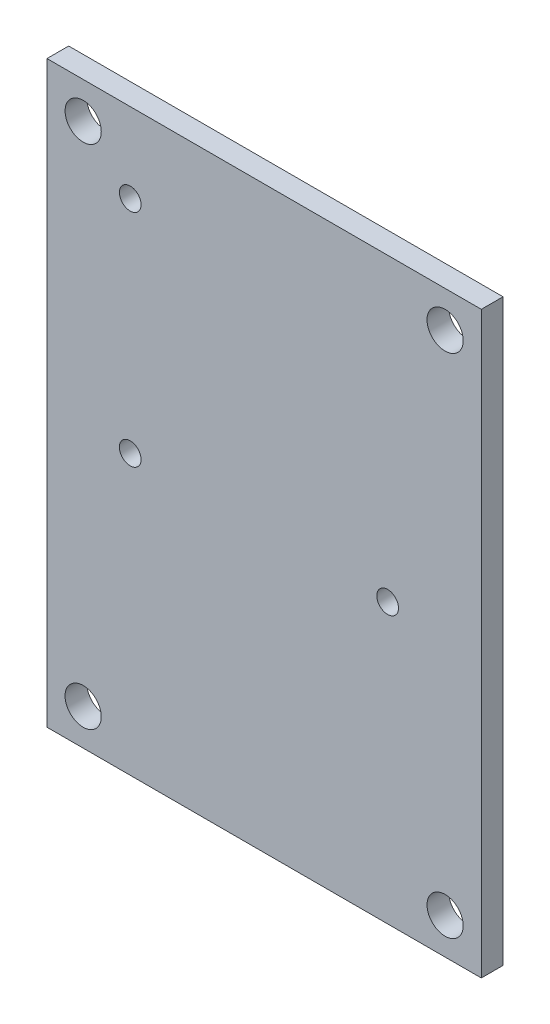
ISO-10303-21;
HEADER;
FILE_DESCRIPTION(('STEP AP214'),'2;1');
FILE_NAME('part.step','',(''),(''),'','','');
FILE_SCHEMA(('AUTOMOTIVE_DESIGN { 1 0 10303 214 1 1 1 1 }'));
ENDSEC;
DATA;
#1=APPLICATION_CONTEXT('core data for automotive mechanical design processes');
#2=APPLICATION_PROTOCOL_DEFINITION('international standard','automotive_design',2000,#1);
#3=PRODUCT_CONTEXT('',#1,'mechanical');
#4=PRODUCT('Part','Part','',(#3));
#5=PRODUCT_RELATED_PRODUCT_CATEGORY('part','',(#4));
#6=PRODUCT_DEFINITION_FORMATION('','',#4);
#7=PRODUCT_DEFINITION_CONTEXT('part definition',#1,'design');
#8=PRODUCT_DEFINITION('design','',#6,#7);
#9=PRODUCT_DEFINITION_SHAPE('','',#8);
#10=(LENGTH_UNIT() NAMED_UNIT(*) SI_UNIT(.MILLI.,.METRE.));
#11=(NAMED_UNIT(*) PLANE_ANGLE_UNIT() SI_UNIT($,.RADIAN.));
#12=(NAMED_UNIT(*) SI_UNIT($,.STERADIAN.) SOLID_ANGLE_UNIT());
#13=UNCERTAINTY_MEASURE_WITH_UNIT(LENGTH_MEASURE(1.E-05),#10,'distance_accuracy_value','');
#14=(GEOMETRIC_REPRESENTATION_CONTEXT(3) GLOBAL_UNCERTAINTY_ASSIGNED_CONTEXT((#13)) GLOBAL_UNIT_ASSIGNED_CONTEXT((#10,
#11,#12)) REPRESENTATION_CONTEXT('',''));
#15=CARTESIAN_POINT('',(0.,0.,0.));
#16=DIRECTION('',(0.,0.,1.));
#17=DIRECTION('',(1.,0.,0.));
#18=AXIS2_PLACEMENT_3D('',#15,#16,#17);
#19=CARTESIAN_POINT('',(30.,40.,-3.));
#20=DIRECTION('',(1.,0.,0.));
#21=DIRECTION('',(0.,1.,0.));
#22=AXIS2_PLACEMENT_3D('',#19,#20,#21);
#23=PLANE('',#22);
#24=DIRECTION('',(0.,1.,0.));
#25=VECTOR('',#24,1.);
#26=CARTESIAN_POINT('',(30.,40.,0.));
#27=LINE('',#26,#25);
#28=CARTESIAN_POINT('',(30.,-40.,0.));
#29=VERTEX_POINT('',#28);
#30=CARTESIAN_POINT('',(30.,40.,0.));
#31=VERTEX_POINT('',#30);
#32=EDGE_CURVE('E102',#29,#31,#27,.T.);
#33=ORIENTED_EDGE('',*,*,#32,.F.);
#34=DIRECTION('',(0.,0.,1.));
#35=VECTOR('',#34,1.);
#36=CARTESIAN_POINT('',(30.,-40.,-3.));
#37=LINE('',#36,#35);
#38=CARTESIAN_POINT('',(30.,-40.,-3.));
#39=VERTEX_POINT('',#38);
#40=EDGE_CURVE('E11',#39,#29,#37,.T.);
#41=ORIENTED_EDGE('',*,*,#40,.F.);
#42=DIRECTION('',(0.,1.,0.));
#43=VECTOR('',#42,1.);
#44=CARTESIAN_POINT('',(30.,40.,-3.));
#45=LINE('',#44,#43);
#46=CARTESIAN_POINT('',(30.,40.,-3.));
#47=VERTEX_POINT('',#46);
#48=EDGE_CURVE('E95',#39,#47,#45,.T.);
#49=ORIENTED_EDGE('',*,*,#48,.T.);
#50=DIRECTION('',(0.,0.,1.));
#51=VECTOR('',#50,1.);
#52=CARTESIAN_POINT('',(30.,40.,-3.));
#53=LINE('',#52,#51);
#54=EDGE_CURVE('E40',#47,#31,#53,.T.);
#55=ORIENTED_EDGE('',*,*,#54,.T.);
#56=EDGE_LOOP('',(#33,#41,#49,#55));
#57=FACE_BOUND('',#56,.T.);
#58=ADVANCED_FACE('F37',(#57),#23,.T.);
#59=CARTESIAN_POINT('',(-30.,-40.,-3.));
#60=DIRECTION('',(0.,-1.,0.));
#61=DIRECTION('',(0.,0.,-1.));
#62=AXIS2_PLACEMENT_3D('',#59,#60,#61);
#63=PLANE('',#62);
#64=DIRECTION('',(1.,0.,0.));
#65=VECTOR('',#64,1.);
#66=CARTESIAN_POINT('',(-30.,-40.,0.));
#67=LINE('',#66,#65);
#68=CARTESIAN_POINT('',(-30.,-40.,0.));
#69=VERTEX_POINT('',#68);
#70=EDGE_CURVE('E97',#69,#29,#67,.T.);
#71=ORIENTED_EDGE('',*,*,#70,.F.);
#72=DIRECTION('',(0.,0.,1.));
#73=VECTOR('',#72,1.);
#74=CARTESIAN_POINT('',(-30.,-40.,-3.));
#75=LINE('',#74,#73);
#76=CARTESIAN_POINT('',(-30.,-40.,-3.));
#77=VERTEX_POINT('',#76);
#78=EDGE_CURVE('E46',#77,#69,#75,.T.);
#79=ORIENTED_EDGE('',*,*,#78,.F.);
#80=DIRECTION('',(1.,0.,0.));
#81=VECTOR('',#80,1.);
#82=CARTESIAN_POINT('',(-30.,-40.,-3.));
#83=LINE('',#82,#81);
#84=EDGE_CURVE('E92',#77,#39,#83,.T.);
#85=ORIENTED_EDGE('',*,*,#84,.T.);
#86=ORIENTED_EDGE('',*,*,#40,.T.);
#87=EDGE_LOOP('',(#71,#79,#85,#86));
#88=FACE_BOUND('',#87,.T.);
#89=ADVANCED_FACE('F113',(#88),#63,.T.);
#90=CARTESIAN_POINT('',(-30.,40.,-3.));
#91=DIRECTION('',(-1.,0.,0.));
#92=DIRECTION('',(0.,-1.,0.));
#93=AXIS2_PLACEMENT_3D('',#90,#91,#92);
#94=PLANE('',#93);
#95=DIRECTION('',(0.,-1.,0.));
#96=VECTOR('',#95,1.);
#97=CARTESIAN_POINT('',(-30.,40.,0.));
#98=LINE('',#97,#96);
#99=CARTESIAN_POINT('',(-30.,40.,0.));
#100=VERTEX_POINT('',#99);
#101=EDGE_CURVE('E87',#100,#69,#98,.T.);
#102=ORIENTED_EDGE('',*,*,#101,.F.);
#103=DIRECTION('',(0.,0.,1.));
#104=VECTOR('',#103,1.);
#105=CARTESIAN_POINT('',(-30.,40.,-3.));
#106=LINE('',#105,#104);
#107=CARTESIAN_POINT('',(-30.,40.,-3.));
#108=VERTEX_POINT('',#107);
#109=EDGE_CURVE('E82',#108,#100,#106,.T.);
#110=ORIENTED_EDGE('',*,*,#109,.F.);
#111=DIRECTION('',(0.,-1.,0.));
#112=VECTOR('',#111,1.);
#113=CARTESIAN_POINT('',(-30.,40.,-3.));
#114=LINE('',#113,#112);
#115=EDGE_CURVE('E85',#108,#77,#114,.T.);
#116=ORIENTED_EDGE('',*,*,#115,.T.);
#117=ORIENTED_EDGE('',*,*,#78,.T.);
#118=EDGE_LOOP('',(#102,#110,#116,#117));
#119=FACE_BOUND('',#118,.T.);
#120=ADVANCED_FACE('F84',(#119),#94,.T.);
#121=CARTESIAN_POINT('',(-30.,40.,-3.));
#122=DIRECTION('',(0.,1.,0.));
#123=DIRECTION('',(0.,0.,1.));
#124=AXIS2_PLACEMENT_3D('',#121,#122,#123);
#125=PLANE('',#124);
#126=DIRECTION('',(-1.,0.,0.));
#127=VECTOR('',#126,1.);
#128=CARTESIAN_POINT('',(-30.,40.,0.));
#129=LINE('',#128,#127);
#130=EDGE_CURVE('E105',#31,#100,#129,.T.);
#131=ORIENTED_EDGE('',*,*,#130,.F.);
#132=ORIENTED_EDGE('',*,*,#54,.F.);
#133=DIRECTION('',(-1.,0.,0.));
#134=VECTOR('',#133,1.);
#135=CARTESIAN_POINT('',(-30.,40.,-3.));
#136=LINE('',#135,#134);
#137=EDGE_CURVE('E91',#47,#108,#136,.T.);
#138=ORIENTED_EDGE('',*,*,#137,.T.);
#139=ORIENTED_EDGE('',*,*,#109,.T.);
#140=EDGE_LOOP('',(#131,#132,#138,#139));
#141=FACE_BOUND('',#140,.T.);
#142=ADVANCED_FACE('F94',(#141),#125,.T.);
#143=CARTESIAN_POINT('',(0.,0.,-3.));
#144=DIRECTION('',(0.,0.,1.));
#145=DIRECTION('',(1.,0.,0.));
#146=AXIS2_PLACEMENT_3D('',#143,#144,#145);
#147=PLANE('',#146);
#148=CARTESIAN_POINT('',(-18.5,29.,-3.));
#149=DIRECTION('',(0.,0.,1.));
#150=DIRECTION('',(1.,0.,0.));
#151=AXIS2_PLACEMENT_3D('',#148,#149,#150);
#152=CIRCLE('',#151,1.5);
#153=CARTESIAN_POINT('',(-17.,29.,-3.));
#154=VERTEX_POINT('',#153);
#155=EDGE_CURVE('E166',#154,#154,#152,.T.);
#156=ORIENTED_EDGE('',*,*,#155,.T.);
#157=EDGE_LOOP('',(#156));
#158=FACE_BOUND('',#157,.T.);
#159=CARTESIAN_POINT('',(-18.5,-1.48,-3.));
#160=DIRECTION('',(0.,0.,1.));
#161=DIRECTION('',(1.,0.,0.));
#162=AXIS2_PLACEMENT_3D('',#159,#160,#161);
#163=CIRCLE('',#162,1.5);
#164=CARTESIAN_POINT('',(-17.,-1.48,-3.));
#165=VERTEX_POINT('',#164);
#166=EDGE_CURVE('E170',#165,#165,#163,.T.);
#167=ORIENTED_EDGE('',*,*,#166,.T.);
#168=EDGE_LOOP('',(#167));
#169=FACE_BOUND('',#168,.T.);
#170=CARTESIAN_POINT('',(17.06,-1.47999999999999,-3.));
#171=DIRECTION('',(0.,0.,1.));
#172=DIRECTION('',(1.,0.,0.));
#173=AXIS2_PLACEMENT_3D('',#170,#171,#172);
#174=CIRCLE('',#173,1.5);
#175=CARTESIAN_POINT('',(18.56,-1.47999999999999,-3.));
#176=VERTEX_POINT('',#175);
#177=EDGE_CURVE('E180',#176,#176,#174,.T.);
#178=ORIENTED_EDGE('',*,*,#177,.T.);
#179=EDGE_LOOP('',(#178));
#180=FACE_BOUND('',#179,.T.);
#181=CARTESIAN_POINT('',(25.,35.,-3.));
#182=DIRECTION('',(0.,0.,1.));
#183=DIRECTION('',(-1.,0.,0.));
#184=AXIS2_PLACEMENT_3D('',#181,#182,#183);
#185=CIRCLE('',#184,2.5);
#186=CARTESIAN_POINT('',(22.5,35.,-3.));
#187=VERTEX_POINT('',#186);
#188=EDGE_CURVE('E199',#187,#187,#185,.T.);
#189=ORIENTED_EDGE('',*,*,#188,.T.);
#190=EDGE_LOOP('',(#189));
#191=FACE_BOUND('',#190,.T.);
#192=CARTESIAN_POINT('',(25.,-35.,-3.));
#193=DIRECTION('',(0.,0.,1.));
#194=DIRECTION('',(1.,0.,0.));
#195=AXIS2_PLACEMENT_3D('',#192,#193,#194);
#196=CIRCLE('',#195,2.5);
#197=CARTESIAN_POINT('',(27.5,-35.,-3.));
#198=VERTEX_POINT('',#197);
#199=EDGE_CURVE('E193',#198,#198,#196,.T.);
#200=ORIENTED_EDGE('',*,*,#199,.T.);
#201=EDGE_LOOP('',(#200));
#202=FACE_BOUND('',#201,.T.);
#203=CARTESIAN_POINT('',(-25.,-35.,-3.));
#204=DIRECTION('',(0.,0.,1.));
#205=DIRECTION('',(-1.,0.,0.));
#206=AXIS2_PLACEMENT_3D('',#203,#204,#205);
#207=CIRCLE('',#206,2.5);
#208=CARTESIAN_POINT('',(-27.5,-35.,-3.));
#209=VERTEX_POINT('',#208);
#210=EDGE_CURVE('E186',#209,#209,#207,.T.);
#211=ORIENTED_EDGE('',*,*,#210,.T.);
#212=EDGE_LOOP('',(#211));
#213=FACE_BOUND('',#212,.T.);
#214=CARTESIAN_POINT('',(-25.,35.,-3.));
#215=DIRECTION('',(0.,0.,1.));
#216=DIRECTION('',(1.,0.,0.));
#217=AXIS2_PLACEMENT_3D('',#214,#215,#216);
#218=CIRCLE('',#217,2.5);
#219=CARTESIAN_POINT('',(-22.5,35.,-3.));
#220=VERTEX_POINT('',#219);
#221=EDGE_CURVE('E106',#220,#220,#218,.T.);
#222=ORIENTED_EDGE('',*,*,#221,.T.);
#223=EDGE_LOOP('',(#222));
#224=FACE_BOUND('',#223,.T.);
#225=ORIENTED_EDGE('',*,*,#48,.F.);
#226=ORIENTED_EDGE('',*,*,#84,.F.);
#227=ORIENTED_EDGE('',*,*,#115,.F.);
#228=ORIENTED_EDGE('',*,*,#137,.F.);
#229=EDGE_LOOP('',(#225,#226,#227,#228));
#230=FACE_BOUND('',#229,.T.);
#231=ADVANCED_FACE('F90',(#158,#169,#180,#191,#202,#213,#224,#230),#147,.F.);
#232=CARTESIAN_POINT('',(0.,0.,0.));
#233=DIRECTION('',(0.,0.,1.));
#234=DIRECTION('',(1.,0.,0.));
#235=AXIS2_PLACEMENT_3D('',#232,#233,#234);
#236=PLANE('',#235);
#237=CARTESIAN_POINT('',(-18.5,29.,0.));
#238=DIRECTION('',(0.,0.,1.));
#239=DIRECTION('',(1.,0.,0.));
#240=AXIS2_PLACEMENT_3D('',#237,#238,#239);
#241=CIRCLE('',#240,1.5);
#242=CARTESIAN_POINT('',(-17.,29.,0.));
#243=VERTEX_POINT('',#242);
#244=EDGE_CURVE('E169',#243,#243,#241,.T.);
#245=ORIENTED_EDGE('',*,*,#244,.F.);
#246=EDGE_LOOP('',(#245));
#247=FACE_BOUND('',#246,.T.);
#248=CARTESIAN_POINT('',(-18.5,-1.48,0.));
#249=DIRECTION('',(0.,0.,1.));
#250=DIRECTION('',(1.,0.,0.));
#251=AXIS2_PLACEMENT_3D('',#248,#249,#250);
#252=CIRCLE('',#251,1.5);
#253=CARTESIAN_POINT('',(-17.,-1.48,0.));
#254=VERTEX_POINT('',#253);
#255=EDGE_CURVE('E175',#254,#254,#252,.T.);
#256=ORIENTED_EDGE('',*,*,#255,.F.);
#257=EDGE_LOOP('',(#256));
#258=FACE_BOUND('',#257,.T.);
#259=CARTESIAN_POINT('',(17.06,-1.47999999999999,0.));
#260=DIRECTION('',(0.,0.,1.));
#261=DIRECTION('',(1.,0.,0.));
#262=AXIS2_PLACEMENT_3D('',#259,#260,#261);
#263=CIRCLE('',#262,1.5);
#264=CARTESIAN_POINT('',(18.56,-1.47999999999999,0.));
#265=VERTEX_POINT('',#264);
#266=EDGE_CURVE('E183',#265,#265,#263,.T.);
#267=ORIENTED_EDGE('',*,*,#266,.F.);
#268=EDGE_LOOP('',(#267));
#269=FACE_BOUND('',#268,.T.);
#270=CARTESIAN_POINT('',(25.,35.,0.));
#271=DIRECTION('',(0.,0.,1.));
#272=DIRECTION('',(-1.,0.,0.));
#273=AXIS2_PLACEMENT_3D('',#270,#271,#272);
#274=CIRCLE('',#273,2.5);
#275=CARTESIAN_POINT('',(22.5,35.,0.));
#276=VERTEX_POINT('',#275);
#277=EDGE_CURVE('E172',#276,#276,#274,.T.);
#278=ORIENTED_EDGE('',*,*,#277,.F.);
#279=EDGE_LOOP('',(#278));
#280=FACE_BOUND('',#279,.T.);
#281=CARTESIAN_POINT('',(25.,-35.,0.));
#282=DIRECTION('',(0.,0.,1.));
#283=DIRECTION('',(1.,0.,0.));
#284=AXIS2_PLACEMENT_3D('',#281,#282,#283);
#285=CIRCLE('',#284,2.5);
#286=CARTESIAN_POINT('',(27.5,-35.,0.));
#287=VERTEX_POINT('',#286);
#288=EDGE_CURVE('E196',#287,#287,#285,.T.);
#289=ORIENTED_EDGE('',*,*,#288,.F.);
#290=EDGE_LOOP('',(#289));
#291=FACE_BOUND('',#290,.T.);
#292=CARTESIAN_POINT('',(-25.,-35.,0.));
#293=DIRECTION('',(0.,0.,1.));
#294=DIRECTION('',(-1.,0.,0.));
#295=AXIS2_PLACEMENT_3D('',#292,#293,#294);
#296=CIRCLE('',#295,2.5);
#297=CARTESIAN_POINT('',(-27.5,-35.,0.));
#298=VERTEX_POINT('',#297);
#299=EDGE_CURVE('E190',#298,#298,#296,.T.);
#300=ORIENTED_EDGE('',*,*,#299,.F.);
#301=EDGE_LOOP('',(#300));
#302=FACE_BOUND('',#301,.T.);
#303=CARTESIAN_POINT('',(-25.,35.,0.));
#304=DIRECTION('',(0.,0.,1.));
#305=DIRECTION('',(1.,0.,0.));
#306=AXIS2_PLACEMENT_3D('',#303,#304,#305);
#307=CIRCLE('',#306,2.5);
#308=CARTESIAN_POINT('',(-22.5,35.,0.));
#309=VERTEX_POINT('',#308);
#310=EDGE_CURVE('E189',#309,#309,#307,.T.);
#311=ORIENTED_EDGE('',*,*,#310,.F.);
#312=EDGE_LOOP('',(#311));
#313=FACE_BOUND('',#312,.T.);
#314=ORIENTED_EDGE('',*,*,#32,.T.);
#315=ORIENTED_EDGE('',*,*,#130,.T.);
#316=ORIENTED_EDGE('',*,*,#101,.T.);
#317=ORIENTED_EDGE('',*,*,#70,.T.);
#318=EDGE_LOOP('',(#314,#315,#316,#317));
#319=FACE_BOUND('',#318,.T.);
#320=ADVANCED_FACE('F112',(#247,#258,#269,#280,#291,#302,#313,#319),#236,.T.);
#321=CARTESIAN_POINT('',(-25.,35.,-3.));
#322=DIRECTION('',(0.,0.,1.));
#323=DIRECTION('',(1.,0.,0.));
#324=AXIS2_PLACEMENT_3D('',#321,#322,#323);
#325=CYLINDRICAL_SURFACE('',#324,2.5);
#326=ORIENTED_EDGE('',*,*,#221,.F.);
#327=EDGE_LOOP('',(#326));
#328=FACE_BOUND('',#327,.T.);
#329=ORIENTED_EDGE('',*,*,#310,.T.);
#330=EDGE_LOOP('',(#329));
#331=FACE_BOUND('',#330,.T.);
#332=ADVANCED_FACE('F131',(#328,#331),#325,.F.);
#333=CARTESIAN_POINT('',(-25.,-35.,-3.));
#334=DIRECTION('',(0.,0.,1.));
#335=DIRECTION('',(1.,0.,0.));
#336=AXIS2_PLACEMENT_3D('',#333,#334,#335);
#337=CYLINDRICAL_SURFACE('',#336,2.5);
#338=ORIENTED_EDGE('',*,*,#210,.F.);
#339=EDGE_LOOP('',(#338));
#340=FACE_BOUND('',#339,.T.);
#341=ORIENTED_EDGE('',*,*,#299,.T.);
#342=EDGE_LOOP('',(#341));
#343=FACE_BOUND('',#342,.T.);
#344=ADVANCED_FACE('F138',(#340,#343),#337,.F.);
#345=CARTESIAN_POINT('',(25.,-35.,-3.));
#346=DIRECTION('',(0.,0.,1.));
#347=DIRECTION('',(1.,0.,0.));
#348=AXIS2_PLACEMENT_3D('',#345,#346,#347);
#349=CYLINDRICAL_SURFACE('',#348,2.5);
#350=ORIENTED_EDGE('',*,*,#199,.F.);
#351=EDGE_LOOP('',(#350));
#352=FACE_BOUND('',#351,.T.);
#353=ORIENTED_EDGE('',*,*,#288,.T.);
#354=EDGE_LOOP('',(#353));
#355=FACE_BOUND('',#354,.T.);
#356=ADVANCED_FACE('F144',(#352,#355),#349,.F.);
#357=CARTESIAN_POINT('',(25.,35.,-3.));
#358=DIRECTION('',(0.,0.,1.));
#359=DIRECTION('',(1.,0.,0.));
#360=AXIS2_PLACEMENT_3D('',#357,#358,#359);
#361=CYLINDRICAL_SURFACE('',#360,2.5);
#362=ORIENTED_EDGE('',*,*,#188,.F.);
#363=EDGE_LOOP('',(#362));
#364=FACE_BOUND('',#363,.T.);
#365=ORIENTED_EDGE('',*,*,#277,.T.);
#366=EDGE_LOOP('',(#365));
#367=FACE_BOUND('',#366,.T.);
#368=ADVANCED_FACE('F140',(#364,#367),#361,.F.);
#369=CARTESIAN_POINT('',(17.06,-1.47999999999999,-3.));
#370=DIRECTION('',(0.,0.,1.));
#371=DIRECTION('',(1.,0.,0.));
#372=AXIS2_PLACEMENT_3D('',#369,#370,#371);
#373=CYLINDRICAL_SURFACE('',#372,1.5);
#374=ORIENTED_EDGE('',*,*,#177,.F.);
#375=EDGE_LOOP('',(#374));
#376=FACE_BOUND('',#375,.T.);
#377=ORIENTED_EDGE('',*,*,#266,.T.);
#378=EDGE_LOOP('',(#377));
#379=FACE_BOUND('',#378,.T.);
#380=ADVANCED_FACE('F143',(#376,#379),#373,.F.);
#381=CARTESIAN_POINT('',(-18.5,-1.48,-3.));
#382=DIRECTION('',(0.,0.,1.));
#383=DIRECTION('',(1.,0.,0.));
#384=AXIS2_PLACEMENT_3D('',#381,#382,#383);
#385=CYLINDRICAL_SURFACE('',#384,1.5);
#386=ORIENTED_EDGE('',*,*,#166,.F.);
#387=EDGE_LOOP('',(#386));
#388=FACE_BOUND('',#387,.T.);
#389=ORIENTED_EDGE('',*,*,#255,.T.);
#390=EDGE_LOOP('',(#389));
#391=FACE_BOUND('',#390,.T.);
#392=ADVANCED_FACE('F154',(#388,#391),#385,.F.);
#393=CARTESIAN_POINT('',(-18.5,29.,-3.));
#394=DIRECTION('',(0.,0.,1.));
#395=DIRECTION('',(1.,0.,0.));
#396=AXIS2_PLACEMENT_3D('',#393,#394,#395);
#397=CYLINDRICAL_SURFACE('',#396,1.5);
#398=ORIENTED_EDGE('',*,*,#155,.F.);
#399=EDGE_LOOP('',(#398));
#400=FACE_BOUND('',#399,.T.);
#401=ORIENTED_EDGE('',*,*,#244,.T.);
#402=EDGE_LOOP('',(#401));
#403=FACE_BOUND('',#402,.T.);
#404=ADVANCED_FACE('F158',(#400,#403),#397,.F.);
#405=CLOSED_SHELL('',(#58,#89,#120,#142,#231,#320,#332,#344,#356,#368,#380,#392,#404));
#406=MANIFOLD_SOLID_BREP('B2',#405);
#407=ADVANCED_BREP_SHAPE_REPRESENTATION('',(#18,#406),#14);
#408=SHAPE_DEFINITION_REPRESENTATION(#9,#407);
ENDSEC;
END-ISO-10303-21;
